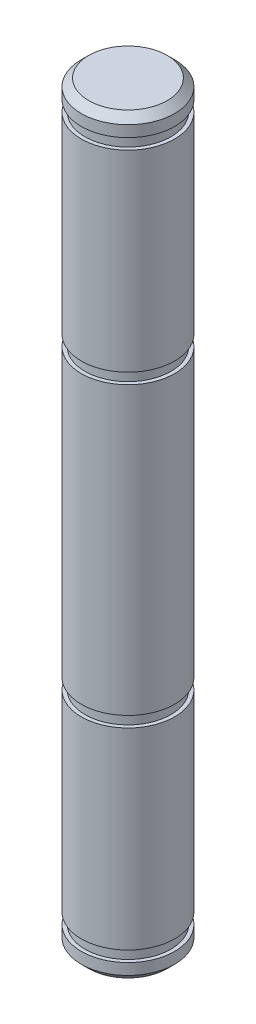
ISO-10303-21;
HEADER;
FILE_DESCRIPTION(('STEP AP214'),'2;1');
FILE_NAME('part.step','',(''),(''),'','','');
FILE_SCHEMA(('AUTOMOTIVE_DESIGN { 1 0 10303 214 1 1 1 1 }'));
ENDSEC;
DATA;
#1=APPLICATION_CONTEXT('core data for automotive mechanical design processes');
#2=APPLICATION_PROTOCOL_DEFINITION('international standard','automotive_design',2000,#1);
#3=PRODUCT_CONTEXT('',#1,'mechanical');
#4=PRODUCT('Part','Part','',(#3));
#5=PRODUCT_RELATED_PRODUCT_CATEGORY('part','',(#4));
#6=PRODUCT_DEFINITION_FORMATION('','',#4);
#7=PRODUCT_DEFINITION_CONTEXT('part definition',#1,'design');
#8=PRODUCT_DEFINITION('design','',#6,#7);
#9=PRODUCT_DEFINITION_SHAPE('','',#8);
#10=(LENGTH_UNIT() NAMED_UNIT(*) SI_UNIT(.MILLI.,.METRE.));
#11=(NAMED_UNIT(*) PLANE_ANGLE_UNIT() SI_UNIT($,.RADIAN.));
#12=(NAMED_UNIT(*) SI_UNIT($,.STERADIAN.) SOLID_ANGLE_UNIT());
#13=UNCERTAINTY_MEASURE_WITH_UNIT(LENGTH_MEASURE(1.E-05),#10,'distance_accuracy_value','');
#14=(GEOMETRIC_REPRESENTATION_CONTEXT(3) GLOBAL_UNCERTAINTY_ASSIGNED_CONTEXT((#13)) GLOBAL_UNIT_ASSIGNED_CONTEXT((#10,
#11,#12)) REPRESENTATION_CONTEXT('',''));
#15=CARTESIAN_POINT('',(0.,0.,0.));
#16=DIRECTION('',(0.,0.,1.));
#17=DIRECTION('',(1.,0.,0.));
#18=AXIS2_PLACEMENT_3D('',#15,#16,#17);
#19=CARTESIAN_POINT('',(0.,-25.5651,0.));
#20=DIRECTION('',(0.,-1.,0.));
#21=DIRECTION('',(1.,0.,0.));
#22=AXIS2_PLACEMENT_3D('',#19,#20,#21);
#23=PLANE('',#22);
#24=CARTESIAN_POINT('',(0.,-25.5651,0.));
#25=DIRECTION('',(0.,-1.,0.));
#26=DIRECTION('',(1.,0.,0.));
#27=AXIS2_PLACEMENT_3D('',#24,#25,#26);
#28=CIRCLE('',#27,2.66699999999997);
#29=CARTESIAN_POINT('',(2.66699999999995,-25.5651,0.));
#30=VERTEX_POINT('',#29);
#31=EDGE_CURVE('E56',#30,#30,#28,.T.);
#32=ORIENTED_EDGE('',*,*,#31,.T.);
#33=EDGE_LOOP('',(#32));
#34=FACE_BOUND('',#33,.T.);
#35=ADVANCED_FACE('F45',(#34),#23,.T.);
#36=CARTESIAN_POINT('',(0.,25.5651,0.));
#37=DIRECTION('',(0.,1.,0.));
#38=DIRECTION('',(-1.,0.,0.));
#39=AXIS2_PLACEMENT_3D('',#36,#37,#38);
#40=CYLINDRICAL_SURFACE('',#39,3.17499999999997);
#41=CARTESIAN_POINT('',(0.,-25.0571,0.));
#42=DIRECTION('',(0.,-1.,0.));
#43=DIRECTION('',(1.,0.,0.));
#44=AXIS2_PLACEMENT_3D('',#41,#42,#43);
#45=CIRCLE('',#44,3.17499999999997);
#46=CARTESIAN_POINT('',(3.17499999999995,-25.0571,0.));
#47=VERTEX_POINT('',#46);
#48=EDGE_CURVE('E60',#47,#47,#45,.F.);
#49=ORIENTED_EDGE('',*,*,#48,.T.);
#50=EDGE_LOOP('',(#49));
#51=FACE_BOUND('',#50,.T.);
#52=CARTESIAN_POINT('',(0.,-24.2951,0.));
#53=DIRECTION('',(0.,1.,0.));
#54=DIRECTION('',(-1.,0.,0.));
#55=AXIS2_PLACEMENT_3D('',#52,#53,#54);
#56=CIRCLE('',#55,3.17499999999997);
#57=CARTESIAN_POINT('',(-3.17499999999999,-24.2951,0.));
#58=VERTEX_POINT('',#57);
#59=EDGE_CURVE('E65',#58,#58,#56,.T.);
#60=ORIENTED_EDGE('',*,*,#59,.F.);
#61=EDGE_LOOP('',(#60));
#62=FACE_BOUND('',#61,.T.);
#63=ADVANCED_FACE('F131',(#51,#62),#40,.T.);
#64=CARTESIAN_POINT('',(-3.17499999999999,-24.2951,0.));
#65=DIRECTION('',(0.,1.,0.));
#66=DIRECTION('',(-1.,0.,0.));
#67=AXIS2_PLACEMENT_3D('',#64,#65,#66);
#68=PLANE('',#67);
#69=ORIENTED_EDGE('',*,*,#59,.T.);
#70=EDGE_LOOP('',(#69));
#71=FACE_BOUND('',#70,.T.);
#72=CARTESIAN_POINT('',(0.,-24.2951,0.));
#73=DIRECTION('',(0.,1.,0.));
#74=DIRECTION('',(-1.,0.,0.));
#75=AXIS2_PLACEMENT_3D('',#72,#73,#74);
#76=CIRCLE('',#75,2.92099999999997);
#77=CARTESIAN_POINT('',(-2.92099999999999,-24.2951,0.));
#78=VERTEX_POINT('',#77);
#79=EDGE_CURVE('E68',#78,#78,#76,.T.);
#80=ORIENTED_EDGE('',*,*,#79,.F.);
#81=EDGE_LOOP('',(#80));
#82=FACE_BOUND('',#81,.T.);
#83=ADVANCED_FACE('F137',(#71,#82),#68,.T.);
#84=CARTESIAN_POINT('',(0.,25.5651,0.));
#85=DIRECTION('',(0.,1.,0.));
#86=DIRECTION('',(-1.,0.,0.));
#87=AXIS2_PLACEMENT_3D('',#84,#85,#86);
#88=CYLINDRICAL_SURFACE('',#87,2.92099999999997);
#89=ORIENTED_EDGE('',*,*,#79,.T.);
#90=EDGE_LOOP('',(#89));
#91=FACE_BOUND('',#90,.T.);
#92=CARTESIAN_POINT('',(0.,-23.5585,0.));
#93=DIRECTION('',(0.,1.,0.));
#94=DIRECTION('',(-1.,0.,0.));
#95=AXIS2_PLACEMENT_3D('',#92,#93,#94);
#96=CIRCLE('',#95,2.92099999999997);
#97=CARTESIAN_POINT('',(-2.92099999999999,-23.5585,0.));
#98=VERTEX_POINT('',#97);
#99=EDGE_CURVE('E71',#98,#98,#96,.T.);
#100=ORIENTED_EDGE('',*,*,#99,.F.);
#101=EDGE_LOOP('',(#100));
#102=FACE_BOUND('',#101,.T.);
#103=ADVANCED_FACE('F158',(#91,#102),#88,.T.);
#104=CARTESIAN_POINT('',(-3.175,-23.5585,0.));
#105=DIRECTION('',(0.,-1.,0.));
#106=DIRECTION('',(1.,0.,0.));
#107=AXIS2_PLACEMENT_3D('',#104,#105,#106);
#108=PLANE('',#107);
#109=ORIENTED_EDGE('',*,*,#99,.T.);
#110=EDGE_LOOP('',(#109));
#111=FACE_BOUND('',#110,.T.);
#112=CARTESIAN_POINT('',(0.,-23.5585,0.));
#113=DIRECTION('',(0.,1.,0.));
#114=DIRECTION('',(-1.,0.,0.));
#115=AXIS2_PLACEMENT_3D('',#112,#113,#114);
#116=CIRCLE('',#115,3.17499999999998);
#117=CARTESIAN_POINT('',(-3.175,-23.5585,0.));
#118=VERTEX_POINT('',#117);
#119=EDGE_CURVE('E74',#118,#118,#116,.T.);
#120=ORIENTED_EDGE('',*,*,#119,.F.);
#121=EDGE_LOOP('',(#120));
#122=FACE_BOUND('',#121,.T.);
#123=ADVANCED_FACE('F163',(#111,#122),#108,.T.);
#124=CARTESIAN_POINT('',(0.,25.5651,0.));
#125=DIRECTION('',(0.,1.,0.));
#126=DIRECTION('',(-1.,0.,0.));
#127=AXIS2_PLACEMENT_3D('',#124,#125,#126);
#128=CYLINDRICAL_SURFACE('',#127,3.17499999999998);
#129=ORIENTED_EDGE('',*,*,#119,.T.);
#130=EDGE_LOOP('',(#129));
#131=FACE_BOUND('',#130,.T.);
#132=CARTESIAN_POINT('',(0.,-10.4775,0.));
#133=DIRECTION('',(0.,1.,0.));
#134=DIRECTION('',(-1.,0.,0.));
#135=AXIS2_PLACEMENT_3D('',#132,#133,#134);
#136=CIRCLE('',#135,3.17499999999998);
#137=CARTESIAN_POINT('',(-3.175,-10.4775,0.));
#138=VERTEX_POINT('',#137);
#139=EDGE_CURVE('E77',#138,#138,#136,.T.);
#140=ORIENTED_EDGE('',*,*,#139,.F.);
#141=EDGE_LOOP('',(#140));
#142=FACE_BOUND('',#141,.T.);
#143=ADVANCED_FACE('F169',(#131,#142),#128,.T.);
#144=CARTESIAN_POINT('',(-3.175,-10.4775,0.));
#145=DIRECTION('',(0.,1.,0.));
#146=DIRECTION('',(-1.,0.,0.));
#147=AXIS2_PLACEMENT_3D('',#144,#145,#146);
#148=PLANE('',#147);
#149=ORIENTED_EDGE('',*,*,#139,.T.);
#150=EDGE_LOOP('',(#149));
#151=FACE_BOUND('',#150,.T.);
#152=CARTESIAN_POINT('',(0.,-10.4775,0.));
#153=DIRECTION('',(0.,1.,0.));
#154=DIRECTION('',(-1.,0.,0.));
#155=AXIS2_PLACEMENT_3D('',#152,#153,#154);
#156=CIRCLE('',#155,2.92099999999998);
#157=CARTESIAN_POINT('',(-2.921,-10.4775,0.));
#158=VERTEX_POINT('',#157);
#159=EDGE_CURVE('E80',#158,#158,#156,.T.);
#160=ORIENTED_EDGE('',*,*,#159,.F.);
#161=EDGE_LOOP('',(#160));
#162=FACE_BOUND('',#161,.T.);
#163=ADVANCED_FACE('F175',(#151,#162),#148,.T.);
#164=CARTESIAN_POINT('',(0.,25.5651,0.));
#165=DIRECTION('',(0.,1.,0.));
#166=DIRECTION('',(-1.,0.,0.));
#167=AXIS2_PLACEMENT_3D('',#164,#165,#166);
#168=CYLINDRICAL_SURFACE('',#167,2.92099999999998);
#169=ORIENTED_EDGE('',*,*,#159,.T.);
#170=EDGE_LOOP('',(#169));
#171=FACE_BOUND('',#170,.T.);
#172=CARTESIAN_POINT('',(0.,-9.74089999999999,0.));
#173=DIRECTION('',(0.,1.,0.));
#174=DIRECTION('',(-1.,0.,0.));
#175=AXIS2_PLACEMENT_3D('',#172,#173,#174);
#176=CIRCLE('',#175,2.92099999999998);
#177=CARTESIAN_POINT('',(-2.921,-9.74089999999999,0.));
#178=VERTEX_POINT('',#177);
#179=EDGE_CURVE('E83',#178,#178,#176,.T.);
#180=ORIENTED_EDGE('',*,*,#179,.F.);
#181=EDGE_LOOP('',(#180));
#182=FACE_BOUND('',#181,.T.);
#183=ADVANCED_FACE('F181',(#171,#182),#168,.T.);
#184=CARTESIAN_POINT('',(-3.175,-9.7409,0.));
#185=DIRECTION('',(0.,-1.,0.));
#186=DIRECTION('',(1.,0.,0.));
#187=AXIS2_PLACEMENT_3D('',#184,#185,#186);
#188=PLANE('',#187);
#189=ORIENTED_EDGE('',*,*,#179,.T.);
#190=EDGE_LOOP('',(#189));
#191=FACE_BOUND('',#190,.T.);
#192=CARTESIAN_POINT('',(0.,-9.74089999999999,0.));
#193=DIRECTION('',(0.,1.,0.));
#194=DIRECTION('',(-1.,0.,0.));
#195=AXIS2_PLACEMENT_3D('',#192,#193,#194);
#196=CIRCLE('',#195,3.17499999999998);
#197=CARTESIAN_POINT('',(-3.17499999999999,-9.74089999999999,0.));
#198=VERTEX_POINT('',#197);
#199=EDGE_CURVE('E86',#198,#198,#196,.T.);
#200=ORIENTED_EDGE('',*,*,#199,.F.);
#201=EDGE_LOOP('',(#200));
#202=FACE_BOUND('',#201,.T.);
#203=ADVANCED_FACE('F187',(#191,#202),#188,.T.);
#204=CARTESIAN_POINT('',(0.,25.5651,0.));
#205=DIRECTION('',(0.,1.,0.));
#206=DIRECTION('',(-1.,0.,0.));
#207=AXIS2_PLACEMENT_3D('',#204,#205,#206);
#208=CYLINDRICAL_SURFACE('',#207,3.17499999999999);
#209=ORIENTED_EDGE('',*,*,#199,.T.);
#210=EDGE_LOOP('',(#209));
#211=FACE_BOUND('',#210,.T.);
#212=CARTESIAN_POINT('',(0.,9.7409,0.));
#213=DIRECTION('',(0.,1.,0.));
#214=DIRECTION('',(-1.,0.,0.));
#215=AXIS2_PLACEMENT_3D('',#212,#213,#214);
#216=CIRCLE('',#215,3.17499999999999);
#217=CARTESIAN_POINT('',(-3.17499999999999,9.7409,0.));
#218=VERTEX_POINT('',#217);
#219=EDGE_CURVE('E89',#218,#218,#216,.T.);
#220=ORIENTED_EDGE('',*,*,#219,.F.);
#221=EDGE_LOOP('',(#220));
#222=FACE_BOUND('',#221,.T.);
#223=ADVANCED_FACE('F193',(#211,#222),#208,.T.);
#224=CARTESIAN_POINT('',(-3.175,9.7409,0.));
#225=DIRECTION('',(0.,1.,0.));
#226=DIRECTION('',(-1.,0.,0.));
#227=AXIS2_PLACEMENT_3D('',#224,#225,#226);
#228=PLANE('',#227);
#229=ORIENTED_EDGE('',*,*,#219,.T.);
#230=EDGE_LOOP('',(#229));
#231=FACE_BOUND('',#230,.T.);
#232=CARTESIAN_POINT('',(0.,9.7409,0.));
#233=DIRECTION('',(0.,1.,0.));
#234=DIRECTION('',(-1.,0.,0.));
#235=AXIS2_PLACEMENT_3D('',#232,#233,#234);
#236=CIRCLE('',#235,2.92099999999999);
#237=CARTESIAN_POINT('',(-2.921,9.7409,0.));
#238=VERTEX_POINT('',#237);
#239=EDGE_CURVE('E92',#238,#238,#236,.T.);
#240=ORIENTED_EDGE('',*,*,#239,.F.);
#241=EDGE_LOOP('',(#240));
#242=FACE_BOUND('',#241,.T.);
#243=ADVANCED_FACE('F199',(#231,#242),#228,.T.);
#244=CARTESIAN_POINT('',(0.,25.5651,0.));
#245=DIRECTION('',(0.,1.,0.));
#246=DIRECTION('',(-1.,0.,0.));
#247=AXIS2_PLACEMENT_3D('',#244,#245,#246);
#248=CYLINDRICAL_SURFACE('',#247,2.92099999999999);
#249=ORIENTED_EDGE('',*,*,#239,.T.);
#250=EDGE_LOOP('',(#249));
#251=FACE_BOUND('',#250,.T.);
#252=CARTESIAN_POINT('',(0.,10.4775,0.));
#253=DIRECTION('',(0.,1.,0.));
#254=DIRECTION('',(-1.,0.,0.));
#255=AXIS2_PLACEMENT_3D('',#252,#253,#254);
#256=CIRCLE('',#255,2.92099999999999);
#257=CARTESIAN_POINT('',(-2.92099999999999,10.4775,0.));
#258=VERTEX_POINT('',#257);
#259=EDGE_CURVE('E95',#258,#258,#256,.T.);
#260=ORIENTED_EDGE('',*,*,#259,.F.);
#261=EDGE_LOOP('',(#260));
#262=FACE_BOUND('',#261,.T.);
#263=ADVANCED_FACE('F205',(#251,#262),#248,.T.);
#264=CARTESIAN_POINT('',(-3.175,10.4775,0.));
#265=DIRECTION('',(0.,-1.,0.));
#266=DIRECTION('',(1.,0.,0.));
#267=AXIS2_PLACEMENT_3D('',#264,#265,#266);
#268=PLANE('',#267);
#269=ORIENTED_EDGE('',*,*,#259,.T.);
#270=EDGE_LOOP('',(#269));
#271=FACE_BOUND('',#270,.T.);
#272=CARTESIAN_POINT('',(0.,10.4775,0.));
#273=DIRECTION('',(0.,1.,0.));
#274=DIRECTION('',(-1.,0.,0.));
#275=AXIS2_PLACEMENT_3D('',#272,#273,#274);
#276=CIRCLE('',#275,3.175);
#277=CARTESIAN_POINT('',(-3.175,10.4775,0.));
#278=VERTEX_POINT('',#277);
#279=EDGE_CURVE('E98',#278,#278,#276,.T.);
#280=ORIENTED_EDGE('',*,*,#279,.F.);
#281=EDGE_LOOP('',(#280));
#282=FACE_BOUND('',#281,.T.);
#283=ADVANCED_FACE('F211',(#271,#282),#268,.T.);
#284=CARTESIAN_POINT('',(0.,25.5651,0.));
#285=DIRECTION('',(0.,1.,0.));
#286=DIRECTION('',(-1.,0.,0.));
#287=AXIS2_PLACEMENT_3D('',#284,#285,#286);
#288=CYLINDRICAL_SURFACE('',#287,3.175);
#289=ORIENTED_EDGE('',*,*,#279,.T.);
#290=EDGE_LOOP('',(#289));
#291=FACE_BOUND('',#290,.T.);
#292=CARTESIAN_POINT('',(0.,23.5585,0.));
#293=DIRECTION('',(0.,1.,0.));
#294=DIRECTION('',(-1.,0.,0.));
#295=AXIS2_PLACEMENT_3D('',#292,#293,#294);
#296=CIRCLE('',#295,3.175);
#297=CARTESIAN_POINT('',(-3.175,23.5585,0.));
#298=VERTEX_POINT('',#297);
#299=EDGE_CURVE('E101',#298,#298,#296,.T.);
#300=ORIENTED_EDGE('',*,*,#299,.F.);
#301=EDGE_LOOP('',(#300));
#302=FACE_BOUND('',#301,.T.);
#303=ADVANCED_FACE('F217',(#291,#302),#288,.T.);
#304=CARTESIAN_POINT('',(-3.175,23.5585,0.));
#305=DIRECTION('',(0.,1.,0.));
#306=DIRECTION('',(-1.,0.,0.));
#307=AXIS2_PLACEMENT_3D('',#304,#305,#306);
#308=PLANE('',#307);
#309=ORIENTED_EDGE('',*,*,#299,.T.);
#310=EDGE_LOOP('',(#309));
#311=FACE_BOUND('',#310,.T.);
#312=CARTESIAN_POINT('',(0.,23.5585,0.));
#313=DIRECTION('',(0.,1.,0.));
#314=DIRECTION('',(-1.,0.,0.));
#315=AXIS2_PLACEMENT_3D('',#312,#313,#314);
#316=CIRCLE('',#315,2.921);
#317=CARTESIAN_POINT('',(-2.92099999999999,23.5585,0.));
#318=VERTEX_POINT('',#317);
#319=EDGE_CURVE('E104',#318,#318,#316,.T.);
#320=ORIENTED_EDGE('',*,*,#319,.F.);
#321=EDGE_LOOP('',(#320));
#322=FACE_BOUND('',#321,.T.);
#323=ADVANCED_FACE('F127',(#311,#322),#308,.T.);
#324=CARTESIAN_POINT('',(0.,25.5651,0.));
#325=DIRECTION('',(0.,1.,0.));
#326=DIRECTION('',(-1.,0.,0.));
#327=AXIS2_PLACEMENT_3D('',#324,#325,#326);
#328=CYLINDRICAL_SURFACE('',#327,2.921);
#329=ORIENTED_EDGE('',*,*,#319,.T.);
#330=EDGE_LOOP('',(#329));
#331=FACE_BOUND('',#330,.T.);
#332=CARTESIAN_POINT('',(0.,24.2951,0.));
#333=DIRECTION('',(0.,1.,0.));
#334=DIRECTION('',(-1.,0.,0.));
#335=AXIS2_PLACEMENT_3D('',#332,#333,#334);
#336=CIRCLE('',#335,2.921);
#337=CARTESIAN_POINT('',(-2.92099999999999,24.2951,0.));
#338=VERTEX_POINT('',#337);
#339=EDGE_CURVE('E107',#338,#338,#336,.T.);
#340=ORIENTED_EDGE('',*,*,#339,.F.);
#341=EDGE_LOOP('',(#340));
#342=FACE_BOUND('',#341,.T.);
#343=ADVANCED_FACE('F118',(#331,#342),#328,.T.);
#344=CARTESIAN_POINT('',(-3.17499999999999,24.2951,0.));
#345=DIRECTION('',(0.,-1.,0.));
#346=DIRECTION('',(1.,0.,0.));
#347=AXIS2_PLACEMENT_3D('',#344,#345,#346);
#348=PLANE('',#347);
#349=ORIENTED_EDGE('',*,*,#339,.T.);
#350=EDGE_LOOP('',(#349));
#351=FACE_BOUND('',#350,.T.);
#352=CARTESIAN_POINT('',(0.,24.2951,0.));
#353=DIRECTION('',(0.,1.,0.));
#354=DIRECTION('',(-1.,0.,0.));
#355=AXIS2_PLACEMENT_3D('',#352,#353,#354);
#356=CIRCLE('',#355,3.175);
#357=CARTESIAN_POINT('',(-3.17499999999999,24.2951,0.));
#358=VERTEX_POINT('',#357);
#359=EDGE_CURVE('E110',#358,#358,#356,.T.);
#360=ORIENTED_EDGE('',*,*,#359,.F.);
#361=EDGE_LOOP('',(#360));
#362=FACE_BOUND('',#361,.T.);
#363=ADVANCED_FACE('F116',(#351,#362),#348,.T.);
#364=CARTESIAN_POINT('',(0.,25.5651,0.));
#365=DIRECTION('',(0.,1.,0.));
#366=DIRECTION('',(-1.,0.,0.));
#367=AXIS2_PLACEMENT_3D('',#364,#365,#366);
#368=CYLINDRICAL_SURFACE('',#367,3.175);
#369=CARTESIAN_POINT('',(0.,25.0571,0.));
#370=DIRECTION('',(0.,1.,0.));
#371=DIRECTION('',(-1.,0.,0.));
#372=AXIS2_PLACEMENT_3D('',#369,#370,#371);
#373=CIRCLE('',#372,3.175);
#374=CARTESIAN_POINT('',(-3.17499999999999,25.0571,0.));
#375=VERTEX_POINT('',#374);
#376=EDGE_CURVE('E12',#375,#375,#373,.F.);
#377=ORIENTED_EDGE('',*,*,#376,.T.);
#378=EDGE_LOOP('',(#377));
#379=FACE_BOUND('',#378,.T.);
#380=ORIENTED_EDGE('',*,*,#359,.T.);
#381=EDGE_LOOP('',(#380));
#382=FACE_BOUND('',#381,.T.);
#383=ADVANCED_FACE('F114',(#379,#382),#368,.T.);
#384=CARTESIAN_POINT('',(0.,25.5651,0.));
#385=DIRECTION('',(0.,1.,0.));
#386=DIRECTION('',(-1.,0.,0.));
#387=AXIS2_PLACEMENT_3D('',#384,#385,#386);
#388=PLANE('',#387);
#389=CARTESIAN_POINT('',(0.,25.5651,0.));
#390=DIRECTION('',(0.,1.,0.));
#391=DIRECTION('',(-1.,0.,0.));
#392=AXIS2_PLACEMENT_3D('',#389,#390,#391);
#393=CIRCLE('',#392,2.667);
#394=CARTESIAN_POINT('',(-2.66699999999999,25.5651,0.));
#395=VERTEX_POINT('',#394);
#396=EDGE_CURVE('E52',#395,#395,#393,.T.);
#397=ORIENTED_EDGE('',*,*,#396,.T.);
#398=EDGE_LOOP('',(#397));
#399=FACE_BOUND('',#398,.T.);
#400=ADVANCED_FACE('F125',(#399),#388,.T.);
#401=CARTESIAN_POINT('',(0.,-25.0571,0.));
#402=DIRECTION('',(0.,1.,0.));
#403=DIRECTION('',(-1.,0.,0.));
#404=AXIS2_PLACEMENT_3D('',#401,#402,#403);
#405=CONICAL_SURFACE('',#404,3.17499999999997,0.785398163397455);
#406=ORIENTED_EDGE('',*,*,#31,.F.);
#407=EDGE_LOOP('',(#406));
#408=FACE_BOUND('',#407,.T.);
#409=ORIENTED_EDGE('',*,*,#48,.F.);
#410=EDGE_LOOP('',(#409));
#411=FACE_BOUND('',#410,.T.);
#412=ADVANCED_FACE('F141',(#408,#411),#405,.T.);
#413=CARTESIAN_POINT('',(0.,25.5651,0.));
#414=DIRECTION('',(0.,-1.,0.));
#415=DIRECTION('',(1.,0.,0.));
#416=AXIS2_PLACEMENT_3D('',#413,#414,#415);
#417=CONICAL_SURFACE('',#416,2.667,0.785398163397444);
#418=ORIENTED_EDGE('',*,*,#376,.F.);
#419=EDGE_LOOP('',(#418));
#420=FACE_BOUND('',#419,.T.);
#421=ORIENTED_EDGE('',*,*,#396,.F.);
#422=EDGE_LOOP('',(#421));
#423=FACE_BOUND('',#422,.T.);
#424=ADVANCED_FACE('F47',(#420,#423),#417,.T.);
#425=CLOSED_SHELL('',(#35,#63,#83,#103,#123,#143,#163,#183,#203,#223,#243,#263,#283,#303,#323,
#343,#363,#383,#400,#412,#424));
#426=MANIFOLD_SOLID_BREP('B2',#425);
#427=ADVANCED_BREP_SHAPE_REPRESENTATION('',(#18,#426),#14);
#428=SHAPE_DEFINITION_REPRESENTATION(#9,#427);
ENDSEC;
END-ISO-10303-21;
